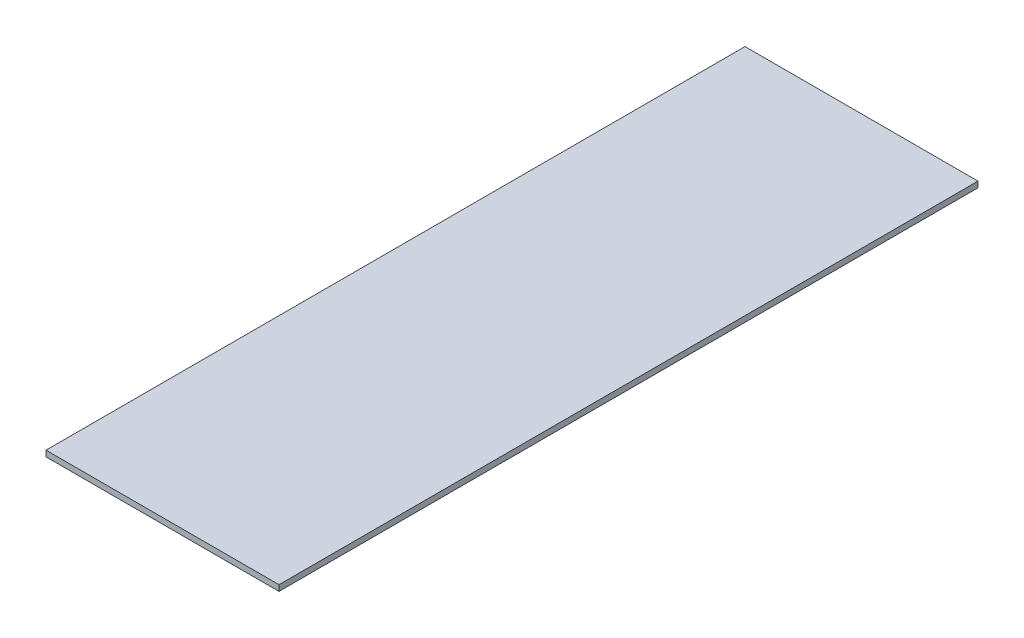
ISO-10303-21;
HEADER;
FILE_DESCRIPTION(('STEP AP214'),'2;1');
FILE_NAME('part.step','',(''),(''),'','','');
FILE_SCHEMA(('AUTOMOTIVE_DESIGN { 1 0 10303 214 1 1 1 1 }'));
ENDSEC;
DATA;
#1=APPLICATION_CONTEXT('core data for automotive mechanical design processes');
#2=APPLICATION_PROTOCOL_DEFINITION('international standard','automotive_design',2000,#1);
#3=PRODUCT_CONTEXT('',#1,'mechanical');
#4=PRODUCT('Part','Part','',(#3));
#5=PRODUCT_RELATED_PRODUCT_CATEGORY('part','',(#4));
#6=PRODUCT_DEFINITION_FORMATION('','',#4);
#7=PRODUCT_DEFINITION_CONTEXT('part definition',#1,'design');
#8=PRODUCT_DEFINITION('design','',#6,#7);
#9=PRODUCT_DEFINITION_SHAPE('','',#8);
#10=(LENGTH_UNIT() NAMED_UNIT(*) SI_UNIT(.MILLI.,.METRE.));
#11=(NAMED_UNIT(*) PLANE_ANGLE_UNIT() SI_UNIT($,.RADIAN.));
#12=(NAMED_UNIT(*) SI_UNIT($,.STERADIAN.) SOLID_ANGLE_UNIT());
#13=UNCERTAINTY_MEASURE_WITH_UNIT(LENGTH_MEASURE(1.E-05),#10,'distance_accuracy_value','');
#14=(GEOMETRIC_REPRESENTATION_CONTEXT(3) GLOBAL_UNCERTAINTY_ASSIGNED_CONTEXT((#13)) GLOBAL_UNIT_ASSIGNED_CONTEXT((#10,
#11,#12)) REPRESENTATION_CONTEXT('',''));
#15=CARTESIAN_POINT('',(0.,0.,0.));
#16=DIRECTION('',(0.,0.,1.));
#17=DIRECTION('',(1.,0.,0.));
#18=AXIS2_PLACEMENT_3D('',#15,#16,#17);
#19=CARTESIAN_POINT('',(127.,-3.175,-381.));
#20=DIRECTION('',(1.,0.,0.));
#21=DIRECTION('',(0.,0.,-1.));
#22=AXIS2_PLACEMENT_3D('',#19,#20,#21);
#23=PLANE('',#22);
#24=DIRECTION('',(0.,1.,0.));
#25=VECTOR('',#24,1.);
#26=CARTESIAN_POINT('',(127.,-3.175,-381.));
#27=LINE('',#26,#25);
#28=CARTESIAN_POINT('',(127.,-3.175,-381.));
#29=VERTEX_POINT('',#28);
#30=CARTESIAN_POINT('',(127.,3.175,-381.));
#31=VERTEX_POINT('',#30);
#32=EDGE_CURVE('E46',#29,#31,#27,.T.);
#33=ORIENTED_EDGE('',*,*,#32,.T.);
#34=DIRECTION('',(0.,0.,-1.));
#35=VECTOR('',#34,1.);
#36=CARTESIAN_POINT('',(127.,3.175,-381.));
#37=LINE('',#36,#35);
#38=CARTESIAN_POINT('',(127.,3.175,381.));
#39=VERTEX_POINT('',#38);
#40=EDGE_CURVE('E84',#39,#31,#37,.T.);
#41=ORIENTED_EDGE('',*,*,#40,.F.);
#42=DIRECTION('',(0.,1.,0.));
#43=VECTOR('',#42,1.);
#44=CARTESIAN_POINT('',(127.,-3.175,381.));
#45=LINE('',#44,#43);
#46=CARTESIAN_POINT('',(127.,-3.175,381.));
#47=VERTEX_POINT('',#46);
#48=EDGE_CURVE('E11',#47,#39,#45,.T.);
#49=ORIENTED_EDGE('',*,*,#48,.F.);
#50=DIRECTION('',(0.,0.,-1.));
#51=VECTOR('',#50,1.);
#52=CARTESIAN_POINT('',(127.,-3.175,-381.));
#53=LINE('',#52,#51);
#54=EDGE_CURVE('E85',#47,#29,#53,.T.);
#55=ORIENTED_EDGE('',*,*,#54,.T.);
#56=EDGE_LOOP('',(#33,#41,#49,#55));
#57=FACE_BOUND('',#56,.T.);
#58=ADVANCED_FACE('F43',(#57),#23,.T.);
#59=CARTESIAN_POINT('',(-127.,-3.175,381.));
#60=DIRECTION('',(0.,0.,1.));
#61=DIRECTION('',(1.,0.,0.));
#62=AXIS2_PLACEMENT_3D('',#59,#60,#61);
#63=PLANE('',#62);
#64=ORIENTED_EDGE('',*,*,#48,.T.);
#65=DIRECTION('',(1.,0.,0.));
#66=VECTOR('',#65,1.);
#67=CARTESIAN_POINT('',(-127.,3.175,381.));
#68=LINE('',#67,#66);
#69=CARTESIAN_POINT('',(-127.,3.175,381.));
#70=VERTEX_POINT('',#69);
#71=EDGE_CURVE('E103',#70,#39,#68,.T.);
#72=ORIENTED_EDGE('',*,*,#71,.F.);
#73=DIRECTION('',(0.,1.,0.));
#74=VECTOR('',#73,1.);
#75=CARTESIAN_POINT('',(-127.,-3.175,381.));
#76=LINE('',#75,#74);
#77=CARTESIAN_POINT('',(-127.,-3.175,381.));
#78=VERTEX_POINT('',#77);
#79=EDGE_CURVE('E52',#78,#70,#76,.T.);
#80=ORIENTED_EDGE('',*,*,#79,.F.);
#81=DIRECTION('',(1.,0.,0.));
#82=VECTOR('',#81,1.);
#83=CARTESIAN_POINT('',(-127.,-3.175,381.));
#84=LINE('',#83,#82);
#85=EDGE_CURVE('E91',#78,#47,#84,.T.);
#86=ORIENTED_EDGE('',*,*,#85,.T.);
#87=EDGE_LOOP('',(#64,#72,#80,#86));
#88=FACE_BOUND('',#87,.T.);
#89=ADVANCED_FACE('F127',(#88),#63,.T.);
#90=CARTESIAN_POINT('',(-127.,-3.175,-381.));
#91=DIRECTION('',(-1.,0.,0.));
#92=DIRECTION('',(0.,0.,1.));
#93=AXIS2_PLACEMENT_3D('',#90,#91,#92);
#94=PLANE('',#93);
#95=ORIENTED_EDGE('',*,*,#79,.T.);
#96=DIRECTION('',(0.,0.,1.));
#97=VECTOR('',#96,1.);
#98=CARTESIAN_POINT('',(-127.,3.175,-381.));
#99=LINE('',#98,#97);
#100=CARTESIAN_POINT('',(-127.,3.175,-381.));
#101=VERTEX_POINT('',#100);
#102=EDGE_CURVE('E99',#101,#70,#99,.T.);
#103=ORIENTED_EDGE('',*,*,#102,.F.);
#104=DIRECTION('',(0.,1.,0.));
#105=VECTOR('',#104,1.);
#106=CARTESIAN_POINT('',(-127.,-3.175,-381.));
#107=LINE('',#106,#105);
#108=CARTESIAN_POINT('',(-127.,-3.175,-381.));
#109=VERTEX_POINT('',#108);
#110=EDGE_CURVE('E90',#109,#101,#107,.T.);
#111=ORIENTED_EDGE('',*,*,#110,.F.);
#112=DIRECTION('',(0.,0.,1.));
#113=VECTOR('',#112,1.);
#114=CARTESIAN_POINT('',(-127.,-3.175,-381.));
#115=LINE('',#114,#113);
#116=EDGE_CURVE('E116',#109,#78,#115,.T.);
#117=ORIENTED_EDGE('',*,*,#116,.T.);
#118=EDGE_LOOP('',(#95,#103,#111,#117));
#119=FACE_BOUND('',#118,.T.);
#120=ADVANCED_FACE('F124',(#119),#94,.T.);
#121=CARTESIAN_POINT('',(-127.,-3.175,-381.));
#122=DIRECTION('',(0.,0.,-1.));
#123=DIRECTION('',(-1.,0.,0.));
#124=AXIS2_PLACEMENT_3D('',#121,#122,#123);
#125=PLANE('',#124);
#126=ORIENTED_EDGE('',*,*,#110,.T.);
#127=DIRECTION('',(-1.,0.,0.));
#128=VECTOR('',#127,1.);
#129=CARTESIAN_POINT('',(-127.,3.175,-381.));
#130=LINE('',#129,#128);
#131=EDGE_CURVE('E93',#31,#101,#130,.T.);
#132=ORIENTED_EDGE('',*,*,#131,.F.);
#133=ORIENTED_EDGE('',*,*,#32,.F.);
#134=DIRECTION('',(-1.,0.,0.));
#135=VECTOR('',#134,1.);
#136=CARTESIAN_POINT('',(-127.,-3.175,-381.));
#137=LINE('',#136,#135);
#138=EDGE_CURVE('E113',#29,#109,#137,.T.);
#139=ORIENTED_EDGE('',*,*,#138,.T.);
#140=EDGE_LOOP('',(#126,#132,#133,#139));
#141=FACE_BOUND('',#140,.T.);
#142=ADVANCED_FACE('F94',(#141),#125,.T.);
#143=CARTESIAN_POINT('',(0.,-3.175,0.));
#144=DIRECTION('',(0.,1.,0.));
#145=DIRECTION('',(0.,0.,1.));
#146=AXIS2_PLACEMENT_3D('',#143,#144,#145);
#147=PLANE('',#146);
#148=ORIENTED_EDGE('',*,*,#54,.F.);
#149=ORIENTED_EDGE('',*,*,#85,.F.);
#150=ORIENTED_EDGE('',*,*,#116,.F.);
#151=ORIENTED_EDGE('',*,*,#138,.F.);
#152=EDGE_LOOP('',(#148,#149,#150,#151));
#153=FACE_BOUND('',#152,.T.);
#154=ADVANCED_FACE('F129',(#153),#147,.F.);
#155=CARTESIAN_POINT('',(0.,3.175,0.));
#156=DIRECTION('',(0.,1.,0.));
#157=DIRECTION('',(0.,0.,1.));
#158=AXIS2_PLACEMENT_3D('',#155,#156,#157);
#159=PLANE('',#158);
#160=ORIENTED_EDGE('',*,*,#40,.T.);
#161=ORIENTED_EDGE('',*,*,#131,.T.);
#162=ORIENTED_EDGE('',*,*,#102,.T.);
#163=ORIENTED_EDGE('',*,*,#71,.T.);
#164=EDGE_LOOP('',(#160,#161,#162,#163));
#165=FACE_BOUND('',#164,.T.);
#166=ADVANCED_FACE('F102',(#165),#159,.T.);
#167=CLOSED_SHELL('',(#58,#89,#120,#142,#154,#166));
#168=MANIFOLD_SOLID_BREP('B2',#167);
#169=ADVANCED_BREP_SHAPE_REPRESENTATION('',(#18,#168),#14);
#170=SHAPE_DEFINITION_REPRESENTATION(#9,#169);
ENDSEC;
END-ISO-10303-21;
